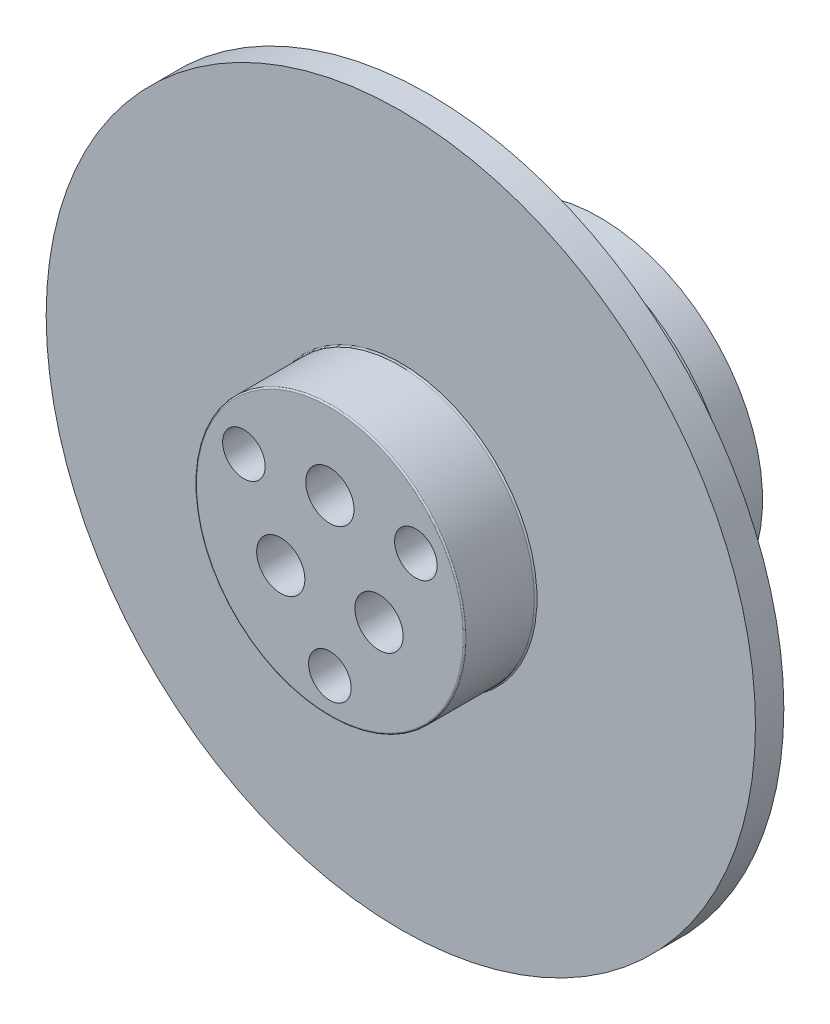
ISO-10303-21;
HEADER;
FILE_DESCRIPTION(('STEP AP214'),'2;1');
FILE_NAME('part.step','',(''),(''),'','','');
FILE_SCHEMA(('AUTOMOTIVE_DESIGN { 1 0 10303 214 1 1 1 1 }'));
ENDSEC;
DATA;
#1=APPLICATION_CONTEXT('core data for automotive mechanical design processes');
#2=APPLICATION_PROTOCOL_DEFINITION('international standard','automotive_design',2000,#1);
#3=PRODUCT_CONTEXT('',#1,'mechanical');
#4=PRODUCT('Part','Part','',(#3));
#5=PRODUCT_RELATED_PRODUCT_CATEGORY('part','',(#4));
#6=PRODUCT_DEFINITION_FORMATION('','',#4);
#7=PRODUCT_DEFINITION_CONTEXT('part definition',#1,'design');
#8=PRODUCT_DEFINITION('design','',#6,#7);
#9=PRODUCT_DEFINITION_SHAPE('','',#8);
#10=(LENGTH_UNIT() NAMED_UNIT(*) SI_UNIT(.MILLI.,.METRE.));
#11=(NAMED_UNIT(*) PLANE_ANGLE_UNIT() SI_UNIT($,.RADIAN.));
#12=(NAMED_UNIT(*) SI_UNIT($,.STERADIAN.) SOLID_ANGLE_UNIT());
#13=UNCERTAINTY_MEASURE_WITH_UNIT(LENGTH_MEASURE(1.E-05),#10,'distance_accuracy_value','');
#14=(GEOMETRIC_REPRESENTATION_CONTEXT(3) GLOBAL_UNCERTAINTY_ASSIGNED_CONTEXT((#13)) GLOBAL_UNIT_ASSIGNED_CONTEXT((#10,
#11,#12)) REPRESENTATION_CONTEXT('',''));
#15=CARTESIAN_POINT('',(0.,0.,0.));
#16=DIRECTION('',(0.,0.,1.));
#17=DIRECTION('',(1.,0.,0.));
#18=AXIS2_PLACEMENT_3D('',#15,#16,#17);
#19=CARTESIAN_POINT('',(0.,0.,5.));
#20=DIRECTION('',(0.,0.,1.));
#21=DIRECTION('',(1.,0.,0.));
#22=AXIS2_PLACEMENT_3D('',#19,#20,#21);
#23=PLANE('',#22);
#24=CARTESIAN_POINT('',(-6.0621778264911,3.49999999999994,5.));
#25=DIRECTION('',(0.,0.,1.));
#26=DIRECTION('',(1.,0.,0.));
#27=AXIS2_PLACEMENT_3D('',#24,#25,#26);
#28=CIRCLE('',#27,1.49999999999999);
#29=CARTESIAN_POINT('',(-4.56217782649111,3.49999999999994,5.));
#30=VERTEX_POINT('',#29);
#31=EDGE_CURVE('E95',#30,#30,#28,.T.);
#32=ORIENTED_EDGE('',*,*,#31,.F.);
#33=EDGE_LOOP('',(#32));
#34=FACE_BOUND('',#33,.T.);
#35=CARTESIAN_POINT('',(6.06217782649105,3.50000000000003,5.));
#36=DIRECTION('',(0.,0.,1.));
#37=DIRECTION('',(1.,0.,0.));
#38=AXIS2_PLACEMENT_3D('',#35,#36,#37);
#39=CIRCLE('',#38,1.49999999999999);
#40=CARTESIAN_POINT('',(7.56217782649104,3.50000000000003,5.));
#41=VERTEX_POINT('',#40);
#42=EDGE_CURVE('E101',#41,#41,#39,.T.);
#43=ORIENTED_EDGE('',*,*,#42,.F.);
#44=EDGE_LOOP('',(#43));
#45=FACE_BOUND('',#44,.T.);
#46=CARTESIAN_POINT('',(0.,-7.,5.));
#47=DIRECTION('',(0.,0.,1.));
#48=DIRECTION('',(1.,0.,0.));
#49=AXIS2_PLACEMENT_3D('',#46,#47,#48);
#50=CIRCLE('',#49,1.49999999999999);
#51=CARTESIAN_POINT('',(1.49999999999999,-7.,5.));
#52=VERTEX_POINT('',#51);
#53=EDGE_CURVE('E107',#52,#52,#50,.T.);
#54=ORIENTED_EDGE('',*,*,#53,.F.);
#55=EDGE_LOOP('',(#54));
#56=FACE_BOUND('',#55,.T.);
#57=CARTESIAN_POINT('',(0.,0.,5.));
#58=DIRECTION('',(0.,0.,1.));
#59=DIRECTION('',(1.,0.,0.));
#60=AXIS2_PLACEMENT_3D('',#57,#58,#59);
#61=CIRCLE('',#60,9.4);
#62=CARTESIAN_POINT('',(9.4,0.,5.));
#63=VERTEX_POINT('',#62);
#64=EDGE_CURVE('E11',#63,#63,#61,.T.);
#65=ORIENTED_EDGE('',*,*,#64,.T.);
#66=EDGE_LOOP('',(#65));
#67=FACE_BOUND('',#66,.T.);
#68=CARTESIAN_POINT('',(0.,4.,5.));
#69=DIRECTION('',(0.,0.,1.));
#70=DIRECTION('',(1.,0.,0.));
#71=AXIS2_PLACEMENT_3D('',#68,#69,#70);
#72=CIRCLE('',#71,1.7);
#73=CARTESIAN_POINT('',(1.7,4.,5.));
#74=VERTEX_POINT('',#73);
#75=EDGE_CURVE('E113',#74,#74,#72,.T.);
#76=ORIENTED_EDGE('',*,*,#75,.F.);
#77=EDGE_LOOP('',(#76));
#78=FACE_BOUND('',#77,.T.);
#79=CARTESIAN_POINT('',(-3.46410161513775,-2.00000000000002,5.));
#80=DIRECTION('',(0.,0.,1.));
#81=DIRECTION('',(1.,0.,0.));
#82=AXIS2_PLACEMENT_3D('',#79,#80,#81);
#83=CIRCLE('',#82,1.7);
#84=CARTESIAN_POINT('',(-1.76410161513775,-2.00000000000002,5.));
#85=VERTEX_POINT('',#84);
#86=EDGE_CURVE('E119',#85,#85,#83,.T.);
#87=ORIENTED_EDGE('',*,*,#86,.F.);
#88=EDGE_LOOP('',(#87));
#89=FACE_BOUND('',#88,.T.);
#90=CARTESIAN_POINT('',(3.46410161513777,-1.99999999999997,5.));
#91=DIRECTION('',(0.,0.,1.));
#92=DIRECTION('',(1.,0.,0.));
#93=AXIS2_PLACEMENT_3D('',#90,#91,#92);
#94=CIRCLE('',#93,1.7);
#95=CARTESIAN_POINT('',(5.16410161513777,-1.99999999999997,5.));
#96=VERTEX_POINT('',#95);
#97=EDGE_CURVE('E116',#96,#96,#94,.T.);
#98=ORIENTED_EDGE('',*,*,#97,.F.);
#99=EDGE_LOOP('',(#98));
#100=FACE_BOUND('',#99,.T.);
#101=ADVANCED_FACE('F41',(#34,#45,#56,#67,#78,#89,#100),#23,.T.);
#102=CARTESIAN_POINT('',(0.,0.,-2.));
#103=DIRECTION('',(0.,0.,-1.));
#104=DIRECTION('',(-1.,0.,0.));
#105=AXIS2_PLACEMENT_3D('',#102,#103,#104);
#106=PLANE('',#105);
#107=CARTESIAN_POINT('',(0.,0.,-2.));
#108=DIRECTION('',(0.,0.,-1.));
#109=DIRECTION('',(-1.,0.,0.));
#110=AXIS2_PLACEMENT_3D('',#107,#108,#109);
#111=CIRCLE('',#110,13.5);
#112=CARTESIAN_POINT('',(-13.5,0.,-2.));
#113=VERTEX_POINT('',#112);
#114=EDGE_CURVE('E178',#113,#113,#111,.T.);
#115=ORIENTED_EDGE('',*,*,#114,.F.);
#116=EDGE_LOOP('',(#115));
#117=FACE_BOUND('',#116,.T.);
#118=CARTESIAN_POINT('',(0.,0.,-2.));
#119=DIRECTION('',(0.,0.,-1.));
#120=DIRECTION('',(-1.,0.,0.));
#121=AXIS2_PLACEMENT_3D('',#118,#119,#120);
#122=CIRCLE('',#121,25.);
#123=CARTESIAN_POINT('',(-25.,0.,-2.));
#124=VERTEX_POINT('',#123);
#125=EDGE_CURVE('E181',#124,#124,#122,.T.);
#126=ORIENTED_EDGE('',*,*,#125,.T.);
#127=EDGE_LOOP('',(#126));
#128=FACE_BOUND('',#127,.T.);
#129=ADVANCED_FACE('F221',(#117,#128),#106,.T.);
#130=CARTESIAN_POINT('',(0.,0.,0.));
#131=DIRECTION('',(0.,0.,-1.));
#132=DIRECTION('',(-1.,0.,0.));
#133=AXIS2_PLACEMENT_3D('',#130,#131,#132);
#134=PLANE('',#133);
#135=CARTESIAN_POINT('',(0.,0.,0.));
#136=DIRECTION('',(0.,0.,-1.));
#137=DIRECTION('',(-1.,0.,0.));
#138=AXIS2_PLACEMENT_3D('',#135,#136,#137);
#139=CIRCLE('',#138,9.6);
#140=CARTESIAN_POINT('',(-9.6,0.,0.));
#141=VERTEX_POINT('',#140);
#142=EDGE_CURVE('E49',#141,#141,#139,.T.);
#143=ORIENTED_EDGE('',*,*,#142,.T.);
#144=EDGE_LOOP('',(#143));
#145=FACE_BOUND('',#144,.T.);
#146=CARTESIAN_POINT('',(0.,0.,0.));
#147=DIRECTION('',(0.,0.,-1.));
#148=DIRECTION('',(-1.,0.,0.));
#149=AXIS2_PLACEMENT_3D('',#146,#147,#148);
#150=CIRCLE('',#149,25.);
#151=CARTESIAN_POINT('',(-25.,0.,0.));
#152=VERTEX_POINT('',#151);
#153=EDGE_CURVE('E185',#152,#152,#150,.T.);
#154=ORIENTED_EDGE('',*,*,#153,.F.);
#155=EDGE_LOOP('',(#154));
#156=FACE_BOUND('',#155,.T.);
#157=ADVANCED_FACE('F199',(#145,#156),#134,.F.);
#158=CARTESIAN_POINT('',(0.,0.,-2.));
#159=DIRECTION('',(0.,0.,1.));
#160=DIRECTION('',(1.,0.,0.));
#161=AXIS2_PLACEMENT_3D('',#158,#159,#160);
#162=CYLINDRICAL_SURFACE('',#161,25.);
#163=ORIENTED_EDGE('',*,*,#125,.F.);
#164=EDGE_LOOP('',(#163));
#165=FACE_BOUND('',#164,.T.);
#166=ORIENTED_EDGE('',*,*,#153,.T.);
#167=EDGE_LOOP('',(#166));
#168=FACE_BOUND('',#167,.T.);
#169=ADVANCED_FACE('F282',(#165,#168),#162,.T.);
#170=CARTESIAN_POINT('',(0.,0.,-4.));
#171=DIRECTION('',(0.,0.,1.));
#172=DIRECTION('',(1.,0.,0.));
#173=AXIS2_PLACEMENT_3D('',#170,#171,#172);
#174=CYLINDRICAL_SURFACE('',#173,13.5);
#175=CARTESIAN_POINT('',(0.,0.,-4.));
#176=DIRECTION('',(0.,0.,-1.));
#177=DIRECTION('',(-1.,0.,0.));
#178=AXIS2_PLACEMENT_3D('',#175,#176,#177);
#179=CIRCLE('',#178,13.5);
#180=CARTESIAN_POINT('',(-13.5,0.,-4.));
#181=VERTEX_POINT('',#180);
#182=EDGE_CURVE('E182',#181,#181,#179,.T.);
#183=ORIENTED_EDGE('',*,*,#182,.F.);
#184=EDGE_LOOP('',(#183));
#185=FACE_BOUND('',#184,.T.);
#186=ORIENTED_EDGE('',*,*,#114,.T.);
#187=EDGE_LOOP('',(#186));
#188=FACE_BOUND('',#187,.T.);
#189=ADVANCED_FACE('F278',(#185,#188),#174,.T.);
#190=CARTESIAN_POINT('',(0.,0.,-4.));
#191=DIRECTION('',(0.,0.,-1.));
#192=DIRECTION('',(-1.,0.,0.));
#193=AXIS2_PLACEMENT_3D('',#190,#191,#192);
#194=PLANE('',#193);
#195=CARTESIAN_POINT('',(0.,0.,-4.));
#196=DIRECTION('',(0.,0.,-1.));
#197=DIRECTION('',(-1.,0.,0.));
#198=AXIS2_PLACEMENT_3D('',#195,#196,#197);
#199=CIRCLE('',#198,12.5);
#200=CARTESIAN_POINT('',(-12.5,0.,-4.));
#201=VERTEX_POINT('',#200);
#202=EDGE_CURVE('E148',#201,#201,#199,.T.);
#203=ORIENTED_EDGE('',*,*,#202,.F.);
#204=EDGE_LOOP('',(#203));
#205=FACE_BOUND('',#204,.T.);
#206=ORIENTED_EDGE('',*,*,#182,.T.);
#207=EDGE_LOOP('',(#206));
#208=FACE_BOUND('',#207,.T.);
#209=ADVANCED_FACE('F274',(#205,#208),#194,.T.);
#210=CARTESIAN_POINT('',(0.,0.,-11.));
#211=DIRECTION('',(0.,0.,1.));
#212=DIRECTION('',(1.,0.,0.));
#213=AXIS2_PLACEMENT_3D('',#210,#211,#212);
#214=CYLINDRICAL_SURFACE('',#213,12.5);
#215=CARTESIAN_POINT('',(0.,0.,-11.));
#216=DIRECTION('',(0.,0.,-1.));
#217=DIRECTION('',(-1.,0.,0.));
#218=AXIS2_PLACEMENT_3D('',#215,#216,#217);
#219=CIRCLE('',#218,12.5);
#220=CARTESIAN_POINT('',(-12.5,0.,-11.));
#221=VERTEX_POINT('',#220);
#222=EDGE_CURVE('E175',#221,#221,#219,.T.);
#223=ORIENTED_EDGE('',*,*,#222,.F.);
#224=EDGE_LOOP('',(#223));
#225=FACE_BOUND('',#224,.T.);
#226=ORIENTED_EDGE('',*,*,#202,.T.);
#227=EDGE_LOOP('',(#226));
#228=FACE_BOUND('',#227,.T.);
#229=ADVANCED_FACE('F270',(#225,#228),#214,.T.);
#230=CARTESIAN_POINT('',(0.,0.,-11.));
#231=DIRECTION('',(0.,0.,-1.));
#232=DIRECTION('',(-1.,0.,0.));
#233=AXIS2_PLACEMENT_3D('',#230,#231,#232);
#234=PLANE('',#233);
#235=CARTESIAN_POINT('',(0.,0.,-11.));
#236=DIRECTION('',(0.,0.,-1.));
#237=DIRECTION('',(-1.,0.,0.));
#238=AXIS2_PLACEMENT_3D('',#235,#236,#237);
#239=CIRCLE('',#238,11.5);
#240=CARTESIAN_POINT('',(-11.5,0.,-11.));
#241=VERTEX_POINT('',#240);
#242=EDGE_CURVE('E144',#241,#241,#239,.T.);
#243=ORIENTED_EDGE('',*,*,#242,.F.);
#244=EDGE_LOOP('',(#243));
#245=FACE_BOUND('',#244,.T.);
#246=ORIENTED_EDGE('',*,*,#222,.T.);
#247=EDGE_LOOP('',(#246));
#248=FACE_BOUND('',#247,.T.);
#249=ADVANCED_FACE('F266',(#245,#248),#234,.T.);
#250=CARTESIAN_POINT('',(0.,4.,-11.));
#251=DIRECTION('',(0.,0.,-1.));
#252=DIRECTION('',(-1.,0.,0.));
#253=AXIS2_PLACEMENT_3D('',#250,#251,#252);
#254=CYLINDRICAL_SURFACE('',#253,1.7);
#255=CARTESIAN_POINT('',(0.,4.,-7.6));
#256=DIRECTION('',(0.,0.,-1.));
#257=DIRECTION('',(-1.,0.,0.));
#258=AXIS2_PLACEMENT_3D('',#255,#256,#257);
#259=CIRCLE('',#258,1.7);
#260=CARTESIAN_POINT('',(-1.7,4.,-7.6));
#261=VERTEX_POINT('',#260);
#262=EDGE_CURVE('E172',#261,#261,#259,.T.);
#263=ORIENTED_EDGE('',*,*,#262,.T.);
#264=EDGE_LOOP('',(#263));
#265=FACE_BOUND('',#264,.T.);
#266=ORIENTED_EDGE('',*,*,#75,.T.);
#267=EDGE_LOOP('',(#266));
#268=FACE_BOUND('',#267,.T.);
#269=ADVANCED_FACE('F262',(#265,#268),#254,.F.);
#270=CARTESIAN_POINT('',(1.7,4.,-7.6));
#271=DIRECTION('',(0.,0.,1.));
#272=DIRECTION('',(1.,0.,0.));
#273=AXIS2_PLACEMENT_3D('',#270,#271,#272);
#274=PLANE('',#273);
#275=ORIENTED_EDGE('',*,*,#262,.F.);
#276=EDGE_LOOP('',(#275));
#277=FACE_BOUND('',#276,.T.);
#278=CARTESIAN_POINT('',(0.,4.,-7.6));
#279=DIRECTION('',(0.,0.,-1.));
#280=DIRECTION('',(-1.,0.,0.));
#281=AXIS2_PLACEMENT_3D('',#278,#279,#280);
#282=CIRCLE('',#281,3.25);
#283=CARTESIAN_POINT('',(-3.25,4.,-7.6));
#284=VERTEX_POINT('',#283);
#285=EDGE_CURVE('E169',#284,#284,#282,.T.);
#286=ORIENTED_EDGE('',*,*,#285,.T.);
#287=EDGE_LOOP('',(#286));
#288=FACE_BOUND('',#287,.T.);
#289=ADVANCED_FACE('F258',(#277,#288),#274,.F.);
#290=CARTESIAN_POINT('',(0.,4.,-11.));
#291=DIRECTION('',(0.,0.,-1.));
#292=DIRECTION('',(-1.,0.,0.));
#293=AXIS2_PLACEMENT_3D('',#290,#291,#292);
#294=CYLINDRICAL_SURFACE('',#293,3.25);
#295=ORIENTED_EDGE('',*,*,#285,.F.);
#296=EDGE_LOOP('',(#295));
#297=FACE_BOUND('',#296,.T.);
#298=CARTESIAN_POINT('',(0.,4.,-14.));
#299=DIRECTION('',(0.,0.,-1.));
#300=DIRECTION('',(-1.,0.,0.));
#301=AXIS2_PLACEMENT_3D('',#298,#299,#300);
#302=CIRCLE('',#301,3.25);
#303=CARTESIAN_POINT('',(-3.25,4.,-14.));
#304=VERTEX_POINT('',#303);
#305=EDGE_CURVE('E131',#304,#304,#302,.F.);
#306=ORIENTED_EDGE('',*,*,#305,.F.);
#307=EDGE_LOOP('',(#306));
#308=FACE_BOUND('',#307,.T.);
#309=ADVANCED_FACE('F254',(#297,#308),#294,.F.);
#310=CARTESIAN_POINT('',(-3.46410161513775,-2.00000000000002,-11.));
#311=DIRECTION('',(0.,0.,-1.));
#312=DIRECTION('',(-1.,0.,0.));
#313=AXIS2_PLACEMENT_3D('',#310,#311,#312);
#314=CYLINDRICAL_SURFACE('',#313,1.7);
#315=CARTESIAN_POINT('',(-3.46410161513775,-2.00000000000002,-7.6));
#316=DIRECTION('',(0.,0.,-1.));
#317=DIRECTION('',(-1.,0.,0.));
#318=AXIS2_PLACEMENT_3D('',#315,#316,#317);
#319=CIRCLE('',#318,1.7);
#320=CARTESIAN_POINT('',(-5.16410161513775,-2.00000000000002,-7.6));
#321=VERTEX_POINT('',#320);
#322=EDGE_CURVE('E166',#321,#321,#319,.T.);
#323=ORIENTED_EDGE('',*,*,#322,.T.);
#324=EDGE_LOOP('',(#323));
#325=FACE_BOUND('',#324,.T.);
#326=ORIENTED_EDGE('',*,*,#86,.T.);
#327=EDGE_LOOP('',(#326));
#328=FACE_BOUND('',#327,.T.);
#329=ADVANCED_FACE('F250',(#325,#328),#314,.F.);
#330=CARTESIAN_POINT('',(-1.76410161513775,-2.00000000000002,-7.6));
#331=DIRECTION('',(0.,0.,1.));
#332=DIRECTION('',(1.,0.,0.));
#333=AXIS2_PLACEMENT_3D('',#330,#331,#332);
#334=PLANE('',#333);
#335=ORIENTED_EDGE('',*,*,#322,.F.);
#336=EDGE_LOOP('',(#335));
#337=FACE_BOUND('',#336,.T.);
#338=CARTESIAN_POINT('',(-3.46410161513775,-2.00000000000002,-7.6));
#339=DIRECTION('',(0.,0.,-1.));
#340=DIRECTION('',(-1.,0.,0.));
#341=AXIS2_PLACEMENT_3D('',#338,#339,#340);
#342=CIRCLE('',#341,3.25);
#343=CARTESIAN_POINT('',(-6.71410161513775,-2.00000000000002,-7.6));
#344=VERTEX_POINT('',#343);
#345=EDGE_CURVE('E163',#344,#344,#342,.T.);
#346=ORIENTED_EDGE('',*,*,#345,.T.);
#347=EDGE_LOOP('',(#346));
#348=FACE_BOUND('',#347,.T.);
#349=ADVANCED_FACE('F243',(#337,#348),#334,.F.);
#350=CARTESIAN_POINT('',(-3.46410161513775,-2.00000000000002,-11.));
#351=DIRECTION('',(0.,0.,-1.));
#352=DIRECTION('',(-1.,0.,0.));
#353=AXIS2_PLACEMENT_3D('',#350,#351,#352);
#354=CYLINDRICAL_SURFACE('',#353,3.25);
#355=ORIENTED_EDGE('',*,*,#345,.F.);
#356=EDGE_LOOP('',(#355));
#357=FACE_BOUND('',#356,.T.);
#358=CARTESIAN_POINT('',(-3.46410161513775,-2.00000000000002,-14.));
#359=DIRECTION('',(0.,0.,-1.));
#360=DIRECTION('',(-1.,0.,0.));
#361=AXIS2_PLACEMENT_3D('',#358,#359,#360);
#362=CIRCLE('',#361,3.25);
#363=CARTESIAN_POINT('',(-6.71410161513775,-2.00000000000002,-14.));
#364=VERTEX_POINT('',#363);
#365=EDGE_CURVE('E128',#364,#364,#362,.F.);
#366=ORIENTED_EDGE('',*,*,#365,.F.);
#367=EDGE_LOOP('',(#366));
#368=FACE_BOUND('',#367,.T.);
#369=ADVANCED_FACE('F233',(#357,#368),#354,.F.);
#370=CARTESIAN_POINT('',(3.46410161513777,-1.99999999999997,-11.));
#371=DIRECTION('',(0.,0.,-1.));
#372=DIRECTION('',(-1.,0.,0.));
#373=AXIS2_PLACEMENT_3D('',#370,#371,#372);
#374=CYLINDRICAL_SURFACE('',#373,1.7);
#375=CARTESIAN_POINT('',(3.46410161513777,-1.99999999999997,-7.6));
#376=DIRECTION('',(0.,0.,-1.));
#377=DIRECTION('',(-1.,0.,0.));
#378=AXIS2_PLACEMENT_3D('',#375,#376,#377);
#379=CIRCLE('',#378,1.7);
#380=CARTESIAN_POINT('',(1.76410161513777,-1.99999999999997,-7.6));
#381=VERTEX_POINT('',#380);
#382=EDGE_CURVE('E160',#381,#381,#379,.T.);
#383=ORIENTED_EDGE('',*,*,#382,.T.);
#384=EDGE_LOOP('',(#383));
#385=FACE_BOUND('',#384,.T.);
#386=ORIENTED_EDGE('',*,*,#97,.T.);
#387=EDGE_LOOP('',(#386));
#388=FACE_BOUND('',#387,.T.);
#389=ADVANCED_FACE('F230',(#385,#388),#374,.F.);
#390=CARTESIAN_POINT('',(5.16410161513777,-1.99999999999997,-7.6));
#391=DIRECTION('',(0.,0.,1.));
#392=DIRECTION('',(1.,0.,0.));
#393=AXIS2_PLACEMENT_3D('',#390,#391,#392);
#394=PLANE('',#393);
#395=ORIENTED_EDGE('',*,*,#382,.F.);
#396=EDGE_LOOP('',(#395));
#397=FACE_BOUND('',#396,.T.);
#398=CARTESIAN_POINT('',(3.46410161513777,-1.99999999999997,-7.6));
#399=DIRECTION('',(0.,0.,-1.));
#400=DIRECTION('',(-1.,0.,0.));
#401=AXIS2_PLACEMENT_3D('',#398,#399,#400);
#402=CIRCLE('',#401,3.25);
#403=CARTESIAN_POINT('',(0.214101615137774,-1.99999999999997,-7.6));
#404=VERTEX_POINT('',#403);
#405=EDGE_CURVE('E157',#404,#404,#402,.T.);
#406=ORIENTED_EDGE('',*,*,#405,.T.);
#407=EDGE_LOOP('',(#406));
#408=FACE_BOUND('',#407,.T.);
#409=ADVANCED_FACE('F232',(#397,#408),#394,.F.);
#410=CARTESIAN_POINT('',(3.46410161513777,-1.99999999999997,-11.));
#411=DIRECTION('',(0.,0.,-1.));
#412=DIRECTION('',(-1.,0.,0.));
#413=AXIS2_PLACEMENT_3D('',#410,#411,#412);
#414=CYLINDRICAL_SURFACE('',#413,3.25);
#415=ORIENTED_EDGE('',*,*,#405,.F.);
#416=EDGE_LOOP('',(#415));
#417=FACE_BOUND('',#416,.T.);
#418=CARTESIAN_POINT('',(3.46410161513777,-1.99999999999997,-14.));
#419=DIRECTION('',(0.,0.,-1.));
#420=DIRECTION('',(-1.,0.,0.));
#421=AXIS2_PLACEMENT_3D('',#418,#419,#420);
#422=CIRCLE('',#421,3.25);
#423=CARTESIAN_POINT('',(0.214101615137774,-1.99999999999997,-14.));
#424=VERTEX_POINT('',#423);
#425=EDGE_CURVE('E134',#424,#424,#422,.F.);
#426=ORIENTED_EDGE('',*,*,#425,.F.);
#427=EDGE_LOOP('',(#426));
#428=FACE_BOUND('',#427,.T.);
#429=ADVANCED_FACE('F240',(#417,#428),#414,.F.);
#430=CARTESIAN_POINT('',(0.,0.,-14.));
#431=DIRECTION('',(0.,0.,1.));
#432=DIRECTION('',(1.,0.,0.));
#433=AXIS2_PLACEMENT_3D('',#430,#431,#432);
#434=CYLINDRICAL_SURFACE('',#433,11.5);
#435=CARTESIAN_POINT('',(0.,0.,-14.));
#436=DIRECTION('',(0.,0.,-1.));
#437=DIRECTION('',(-1.,0.,0.));
#438=AXIS2_PLACEMENT_3D('',#435,#436,#437);
#439=CIRCLE('',#438,11.5);
#440=CARTESIAN_POINT('',(-11.5,0.,-14.));
#441=VERTEX_POINT('',#440);
#442=EDGE_CURVE('E140',#441,#441,#439,.T.);
#443=ORIENTED_EDGE('',*,*,#442,.F.);
#444=EDGE_LOOP('',(#443));
#445=FACE_BOUND('',#444,.T.);
#446=ORIENTED_EDGE('',*,*,#242,.T.);
#447=EDGE_LOOP('',(#446));
#448=FACE_BOUND('',#447,.T.);
#449=ADVANCED_FACE('F354',(#445,#448),#434,.T.);
#450=CARTESIAN_POINT('',(0.,0.,-14.));
#451=DIRECTION('',(0.,0.,-1.));
#452=DIRECTION('',(-1.,0.,0.));
#453=AXIS2_PLACEMENT_3D('',#450,#451,#452);
#454=PLANE('',#453);
#455=CARTESIAN_POINT('',(4.24999999999998,-7.36121593216774,-14.));
#456=DIRECTION('',(0.,0.,-1.));
#457=DIRECTION('',(-1.,0.,0.));
#458=AXIS2_PLACEMENT_3D('',#455,#456,#457);
#459=CIRCLE('',#458,1.49999999999999);
#460=CARTESIAN_POINT('',(2.74999999999999,-7.36121593216774,-14.));
#461=VERTEX_POINT('',#460);
#462=EDGE_CURVE('E85',#461,#461,#459,.T.);
#463=ORIENTED_EDGE('',*,*,#462,.F.);
#464=EDGE_LOOP('',(#463));
#465=FACE_BOUND('',#464,.T.);
#466=CARTESIAN_POINT('',(-4.24999999999998,7.36121593216774,-14.));
#467=DIRECTION('',(0.,0.,-1.));
#468=DIRECTION('',(-1.,0.,0.));
#469=AXIS2_PLACEMENT_3D('',#466,#467,#468);
#470=CIRCLE('',#469,1.49999999999999);
#471=CARTESIAN_POINT('',(-5.74999999999997,7.36121593216774,-14.));
#472=VERTEX_POINT('',#471);
#473=EDGE_CURVE('E84',#472,#472,#470,.T.);
#474=ORIENTED_EDGE('',*,*,#473,.F.);
#475=EDGE_LOOP('',(#474));
#476=FACE_BOUND('',#475,.T.);
#477=CARTESIAN_POINT('',(-6.0621778264911,3.49999999999994,-14.));
#478=DIRECTION('',(0.,0.,-1.));
#479=DIRECTION('',(-1.,0.,0.));
#480=AXIS2_PLACEMENT_3D('',#477,#478,#479);
#481=CIRCLE('',#480,1.65);
#482=CARTESIAN_POINT('',(-7.7121778264911,3.49999999999994,-14.));
#483=VERTEX_POINT('',#482);
#484=EDGE_CURVE('E122',#483,#483,#481,.F.);
#485=ORIENTED_EDGE('',*,*,#484,.T.);
#486=EDGE_LOOP('',(#485));
#487=FACE_BOUND('',#486,.T.);
#488=CARTESIAN_POINT('',(0.,-7.,-14.));
#489=DIRECTION('',(0.,0.,-1.));
#490=DIRECTION('',(-1.,0.,0.));
#491=AXIS2_PLACEMENT_3D('',#488,#489,#490);
#492=CIRCLE('',#491,1.65);
#493=CARTESIAN_POINT('',(-1.65,-7.,-14.));
#494=VERTEX_POINT('',#493);
#495=EDGE_CURVE('E125',#494,#494,#492,.F.);
#496=ORIENTED_EDGE('',*,*,#495,.T.);
#497=EDGE_LOOP('',(#496));
#498=FACE_BOUND('',#497,.T.);
#499=ORIENTED_EDGE('',*,*,#365,.T.);
#500=EDGE_LOOP('',(#499));
#501=FACE_BOUND('',#500,.T.);
#502=ORIENTED_EDGE('',*,*,#305,.T.);
#503=EDGE_LOOP('',(#502));
#504=FACE_BOUND('',#503,.T.);
#505=ORIENTED_EDGE('',*,*,#425,.T.);
#506=EDGE_LOOP('',(#505));
#507=FACE_BOUND('',#506,.T.);
#508=CARTESIAN_POINT('',(6.06217782649106,3.50000000000003,-14.));
#509=DIRECTION('',(0.,0.,-1.));
#510=DIRECTION('',(-1.,0.,0.));
#511=AXIS2_PLACEMENT_3D('',#508,#509,#510);
#512=CIRCLE('',#511,1.65);
#513=CARTESIAN_POINT('',(4.41217782649106,3.50000000000003,-14.));
#514=VERTEX_POINT('',#513);
#515=EDGE_CURVE('E137',#514,#514,#512,.F.);
#516=ORIENTED_EDGE('',*,*,#515,.T.);
#517=EDGE_LOOP('',(#516));
#518=FACE_BOUND('',#517,.T.);
#519=ORIENTED_EDGE('',*,*,#442,.T.);
#520=EDGE_LOOP('',(#519));
#521=FACE_BOUND('',#520,.T.);
#522=ADVANCED_FACE('F363',(#465,#476,#487,#498,#501,#504,#507,#518,#521),#454,.T.);
#523=CARTESIAN_POINT('',(0.,-7.,-6.));
#524=DIRECTION('',(0.,0.,-1.));
#525=DIRECTION('',(-1.,0.,0.));
#526=AXIS2_PLACEMENT_3D('',#523,#524,#525);
#527=CONICAL_SURFACE('',#526,1.65,1.02974425867665);
#528=CARTESIAN_POINT('',(0.,-7.,-5.00857997860452));
#529=VERTEX_POINT('',#528);
#530=VERTEX_LOOP('',#529);
#531=FACE_BOUND('',#530,.T.);
#532=CARTESIAN_POINT('',(0.,-7.,-6.));
#533=DIRECTION('',(0.,0.,-1.));
#534=DIRECTION('',(-1.,0.,0.));
#535=AXIS2_PLACEMENT_3D('',#532,#533,#534);
#536=CIRCLE('',#535,1.65);
#537=CARTESIAN_POINT('',(-1.65,-7.,-6.));
#538=VERTEX_POINT('',#537);
#539=EDGE_CURVE('E154',#538,#538,#536,.T.);
#540=ORIENTED_EDGE('',*,*,#539,.T.);
#541=EDGE_LOOP('',(#540));
#542=FACE_BOUND('',#541,.T.);
#543=ADVANCED_FACE('F377',(#531,#542),#527,.F.);
#544=CARTESIAN_POINT('',(0.,-7.,-11.));
#545=DIRECTION('',(0.,0.,-1.));
#546=DIRECTION('',(-1.,0.,0.));
#547=AXIS2_PLACEMENT_3D('',#544,#545,#546);
#548=CYLINDRICAL_SURFACE('',#547,1.65);
#549=ORIENTED_EDGE('',*,*,#539,.F.);
#550=EDGE_LOOP('',(#549));
#551=FACE_BOUND('',#550,.T.);
#552=ORIENTED_EDGE('',*,*,#495,.F.);
#553=EDGE_LOOP('',(#552));
#554=FACE_BOUND('',#553,.T.);
#555=ADVANCED_FACE('F371',(#551,#554),#548,.F.);
#556=CARTESIAN_POINT('',(6.06217782649106,3.50000000000003,-6.));
#557=DIRECTION('',(0.,0.,-1.));
#558=DIRECTION('',(-1.,0.,0.));
#559=AXIS2_PLACEMENT_3D('',#556,#557,#558);
#560=CONICAL_SURFACE('',#559,1.65,1.02974425867665);
#561=CARTESIAN_POINT('',(6.06217782649105,3.50000000000003,-5.00857997860452));
#562=VERTEX_POINT('',#561);
#563=VERTEX_LOOP('',#562);
#564=FACE_BOUND('',#563,.T.);
#565=CARTESIAN_POINT('',(6.06217782649106,3.50000000000003,-6.));
#566=DIRECTION('',(0.,0.,-1.));
#567=DIRECTION('',(-1.,0.,0.));
#568=AXIS2_PLACEMENT_3D('',#565,#566,#567);
#569=CIRCLE('',#568,1.65);
#570=CARTESIAN_POINT('',(4.41217782649106,3.50000000000003,-6.));
#571=VERTEX_POINT('',#570);
#572=EDGE_CURVE('E151',#571,#571,#569,.T.);
#573=ORIENTED_EDGE('',*,*,#572,.T.);
#574=EDGE_LOOP('',(#573));
#575=FACE_BOUND('',#574,.T.);
#576=ADVANCED_FACE('F376',(#564,#575),#560,.F.);
#577=CARTESIAN_POINT('',(6.06217782649106,3.50000000000003,-11.));
#578=DIRECTION('',(0.,0.,-1.));
#579=DIRECTION('',(-1.,0.,0.));
#580=AXIS2_PLACEMENT_3D('',#577,#578,#579);
#581=CYLINDRICAL_SURFACE('',#580,1.65);
#582=ORIENTED_EDGE('',*,*,#572,.F.);
#583=EDGE_LOOP('',(#582));
#584=FACE_BOUND('',#583,.T.);
#585=ORIENTED_EDGE('',*,*,#515,.F.);
#586=EDGE_LOOP('',(#585));
#587=FACE_BOUND('',#586,.T.);
#588=ADVANCED_FACE('F387',(#584,#587),#581,.F.);
#589=CARTESIAN_POINT('',(-6.0621778264911,3.49999999999994,-6.));
#590=DIRECTION('',(0.,0.,-1.));
#591=DIRECTION('',(-1.,0.,0.));
#592=AXIS2_PLACEMENT_3D('',#589,#590,#591);
#593=CONICAL_SURFACE('',#592,1.65,1.02974425867665);
#594=CARTESIAN_POINT('',(-6.06217782649111,3.49999999999994,-5.00857997860452));
#595=VERTEX_POINT('',#594);
#596=VERTEX_LOOP('',#595);
#597=FACE_BOUND('',#596,.T.);
#598=CARTESIAN_POINT('',(-6.0621778264911,3.49999999999994,-6.));
#599=DIRECTION('',(0.,0.,-1.));
#600=DIRECTION('',(-1.,0.,0.));
#601=AXIS2_PLACEMENT_3D('',#598,#599,#600);
#602=CIRCLE('',#601,1.65);
#603=CARTESIAN_POINT('',(-7.7121778264911,3.49999999999994,-6.));
#604=VERTEX_POINT('',#603);
#605=EDGE_CURVE('E143',#604,#604,#602,.T.);
#606=ORIENTED_EDGE('',*,*,#605,.T.);
#607=EDGE_LOOP('',(#606));
#608=FACE_BOUND('',#607,.T.);
#609=ADVANCED_FACE('F391',(#597,#608),#593,.F.);
#610=CARTESIAN_POINT('',(-6.0621778264911,3.49999999999994,-11.));
#611=DIRECTION('',(0.,0.,-1.));
#612=DIRECTION('',(-1.,0.,0.));
#613=AXIS2_PLACEMENT_3D('',#610,#611,#612);
#614=CYLINDRICAL_SURFACE('',#613,1.65);
#615=ORIENTED_EDGE('',*,*,#605,.F.);
#616=EDGE_LOOP('',(#615));
#617=FACE_BOUND('',#616,.T.);
#618=ORIENTED_EDGE('',*,*,#484,.F.);
#619=EDGE_LOOP('',(#618));
#620=FACE_BOUND('',#619,.T.);
#621=ADVANCED_FACE('F210',(#617,#620),#614,.F.);
#622=CARTESIAN_POINT('',(0.,0.,0.));
#623=DIRECTION('',(0.,0.,1.));
#624=DIRECTION('',(1.,0.,0.));
#625=AXIS2_PLACEMENT_3D('',#622,#623,#624);
#626=CYLINDRICAL_SURFACE('',#625,9.5);
#627=CARTESIAN_POINT('',(0.,0.,0.0999999999999996));
#628=DIRECTION('',(0.,0.,-1.));
#629=DIRECTION('',(-1.,0.,0.));
#630=AXIS2_PLACEMENT_3D('',#627,#628,#629);
#631=CIRCLE('',#630,9.5);
#632=CARTESIAN_POINT('',(-9.5,0.,0.0999999999999996));
#633=VERTEX_POINT('',#632);
#634=EDGE_CURVE('E194',#633,#633,#631,.F.);
#635=ORIENTED_EDGE('',*,*,#634,.T.);
#636=EDGE_LOOP('',(#635));
#637=FACE_BOUND('',#636,.T.);
#638=CARTESIAN_POINT('',(0.,0.,4.9));
#639=DIRECTION('',(0.,0.,1.));
#640=DIRECTION('',(1.,0.,0.));
#641=AXIS2_PLACEMENT_3D('',#638,#639,#640);
#642=CIRCLE('',#641,9.5);
#643=CARTESIAN_POINT('',(9.5,0.,4.9));
#644=VERTEX_POINT('',#643);
#645=EDGE_CURVE('E147',#644,#644,#642,.F.);
#646=ORIENTED_EDGE('',*,*,#645,.T.);
#647=EDGE_LOOP('',(#646));
#648=FACE_BOUND('',#647,.T.);
#649=ADVANCED_FACE('F205',(#637,#648),#626,.T.);
#650=CARTESIAN_POINT('',(0.,0.,0.0999999999999996));
#651=DIRECTION('',(0.,0.,-1.));
#652=DIRECTION('',(-1.,0.,0.));
#653=AXIS2_PLACEMENT_3D('',#650,#651,#652);
#654=TOROIDAL_SURFACE('',#653,9.6,0.1);
#655=ORIENTED_EDGE('',*,*,#142,.F.);
#656=EDGE_LOOP('',(#655));
#657=FACE_BOUND('',#656,.T.);
#658=ORIENTED_EDGE('',*,*,#634,.F.);
#659=EDGE_LOOP('',(#658));
#660=FACE_BOUND('',#659,.T.);
#661=ADVANCED_FACE('F202',(#657,#660),#654,.F.);
#662=CARTESIAN_POINT('',(0.,0.,4.9));
#663=DIRECTION('',(0.,0.,1.));
#664=DIRECTION('',(1.,0.,0.));
#665=AXIS2_PLACEMENT_3D('',#662,#663,#664);
#666=TOROIDAL_SURFACE('',#665,9.4,0.1);
#667=ORIENTED_EDGE('',*,*,#645,.F.);
#668=EDGE_LOOP('',(#667));
#669=FACE_BOUND('',#668,.T.);
#670=ORIENTED_EDGE('',*,*,#64,.F.);
#671=EDGE_LOOP('',(#670));
#672=FACE_BOUND('',#671,.T.);
#673=ADVANCED_FACE('F43',(#669,#672),#666,.T.);
#674=CARTESIAN_POINT('',(0.,-7.,0.));
#675=DIRECTION('',(0.,0.,1.));
#676=DIRECTION('',(1.,0.,0.));
#677=AXIS2_PLACEMENT_3D('',#674,#675,#676);
#678=CONICAL_SURFACE('',#677,1.5,1.02974425867665);
#679=CARTESIAN_POINT('',(0.,-7.,-0.901290928541342));
#680=VERTEX_POINT('',#679);
#681=VERTEX_LOOP('',#680);
#682=FACE_BOUND('',#681,.T.);
#683=CARTESIAN_POINT('',(0.,-7.,0.));
#684=DIRECTION('',(0.,0.,1.));
#685=DIRECTION('',(1.,0.,0.));
#686=AXIS2_PLACEMENT_3D('',#683,#684,#685);
#687=CIRCLE('',#686,1.5);
#688=CARTESIAN_POINT('',(1.5,-7.,0.));
#689=VERTEX_POINT('',#688);
#690=EDGE_CURVE('E110',#689,#689,#687,.T.);
#691=ORIENTED_EDGE('',*,*,#690,.T.);
#692=EDGE_LOOP('',(#691));
#693=FACE_BOUND('',#692,.T.);
#694=ADVANCED_FACE('F216',(#682,#693),#678,.F.);
#695=CARTESIAN_POINT('',(0.,-7.,5.));
#696=DIRECTION('',(0.,0.,1.));
#697=DIRECTION('',(1.,0.,0.));
#698=AXIS2_PLACEMENT_3D('',#695,#696,#697);
#699=CYLINDRICAL_SURFACE('',#698,1.49999999999999);
#700=ORIENTED_EDGE('',*,*,#690,.F.);
#701=EDGE_LOOP('',(#700));
#702=FACE_BOUND('',#701,.T.);
#703=ORIENTED_EDGE('',*,*,#53,.T.);
#704=EDGE_LOOP('',(#703));
#705=FACE_BOUND('',#704,.T.);
#706=ADVANCED_FACE('F424',(#702,#705),#699,.F.);
#707=CARTESIAN_POINT('',(6.06217782649105,3.50000000000003,0.));
#708=DIRECTION('',(0.,0.,1.));
#709=DIRECTION('',(1.,0.,0.));
#710=AXIS2_PLACEMENT_3D('',#707,#708,#709);
#711=CONICAL_SURFACE('',#710,1.5,1.02974425867665);
#712=CARTESIAN_POINT('',(6.06217782649105,3.50000000000003,-0.901290928541342));
#713=VERTEX_POINT('',#712);
#714=VERTEX_LOOP('',#713);
#715=FACE_BOUND('',#714,.T.);
#716=CARTESIAN_POINT('',(6.06217782649105,3.50000000000003,0.));
#717=DIRECTION('',(0.,0.,1.));
#718=DIRECTION('',(1.,0.,0.));
#719=AXIS2_PLACEMENT_3D('',#716,#717,#718);
#720=CIRCLE('',#719,1.5);
#721=CARTESIAN_POINT('',(7.56217782649105,3.50000000000003,0.));
#722=VERTEX_POINT('',#721);
#723=EDGE_CURVE('E104',#722,#722,#720,.T.);
#724=ORIENTED_EDGE('',*,*,#723,.T.);
#725=EDGE_LOOP('',(#724));
#726=FACE_BOUND('',#725,.T.);
#727=ADVANCED_FACE('F432',(#715,#726),#711,.F.);
#728=CARTESIAN_POINT('',(6.06217782649105,3.50000000000003,5.));
#729=DIRECTION('',(0.,0.,1.));
#730=DIRECTION('',(1.,0.,0.));
#731=AXIS2_PLACEMENT_3D('',#728,#729,#730);
#732=CYLINDRICAL_SURFACE('',#731,1.49999999999999);
#733=ORIENTED_EDGE('',*,*,#723,.F.);
#734=EDGE_LOOP('',(#733));
#735=FACE_BOUND('',#734,.T.);
#736=ORIENTED_EDGE('',*,*,#42,.T.);
#737=EDGE_LOOP('',(#736));
#738=FACE_BOUND('',#737,.T.);
#739=ADVANCED_FACE('F441',(#735,#738),#732,.F.);
#740=CARTESIAN_POINT('',(-6.0621778264911,3.49999999999994,0.));
#741=DIRECTION('',(0.,0.,1.));
#742=DIRECTION('',(1.,0.,0.));
#743=AXIS2_PLACEMENT_3D('',#740,#741,#742);
#744=CONICAL_SURFACE('',#743,1.5,1.02974425867665);
#745=CARTESIAN_POINT('',(-6.0621778264911,3.49999999999994,-0.901290928541342));
#746=VERTEX_POINT('',#745);
#747=VERTEX_LOOP('',#746);
#748=FACE_BOUND('',#747,.T.);
#749=CARTESIAN_POINT('',(-6.0621778264911,3.49999999999994,0.));
#750=DIRECTION('',(0.,0.,1.));
#751=DIRECTION('',(1.,0.,0.));
#752=AXIS2_PLACEMENT_3D('',#749,#750,#751);
#753=CIRCLE('',#752,1.5);
#754=CARTESIAN_POINT('',(-4.56217782649111,3.49999999999994,0.));
#755=VERTEX_POINT('',#754);
#756=EDGE_CURVE('E98',#755,#755,#753,.T.);
#757=ORIENTED_EDGE('',*,*,#756,.T.);
#758=EDGE_LOOP('',(#757));
#759=FACE_BOUND('',#758,.T.);
#760=ADVANCED_FACE('F449',(#748,#759),#744,.F.);
#761=CARTESIAN_POINT('',(-6.0621778264911,3.49999999999994,5.));
#762=DIRECTION('',(0.,0.,1.));
#763=DIRECTION('',(1.,0.,0.));
#764=AXIS2_PLACEMENT_3D('',#761,#762,#763);
#765=CYLINDRICAL_SURFACE('',#764,1.49999999999999);
#766=ORIENTED_EDGE('',*,*,#756,.F.);
#767=EDGE_LOOP('',(#766));
#768=FACE_BOUND('',#767,.T.);
#769=ORIENTED_EDGE('',*,*,#31,.T.);
#770=EDGE_LOOP('',(#769));
#771=FACE_BOUND('',#770,.T.);
#772=ADVANCED_FACE('F457',(#768,#771),#765,.F.);
#773=CARTESIAN_POINT('',(-4.24999999999998,7.36121593216774,-8.99999999999999));
#774=DIRECTION('',(0.,0.,-1.));
#775=DIRECTION('',(-1.,0.,0.));
#776=AXIS2_PLACEMENT_3D('',#773,#774,#775);
#777=CONICAL_SURFACE('',#776,1.49999999999999,1.02974425867665);
#778=CARTESIAN_POINT('',(-4.24999999999998,7.36121593216774,-8.09870907145866));
#779=VERTEX_POINT('',#778);
#780=VERTEX_LOOP('',#779);
#781=FACE_BOUND('',#780,.T.);
#782=CARTESIAN_POINT('',(-4.24999999999998,7.36121593216774,-8.99999999999999));
#783=DIRECTION('',(0.,0.,-1.));
#784=DIRECTION('',(-1.,0.,0.));
#785=AXIS2_PLACEMENT_3D('',#782,#783,#784);
#786=CIRCLE('',#785,1.49999999999999);
#787=CARTESIAN_POINT('',(-5.74999999999997,7.36121593216774,-8.99999999999999));
#788=VERTEX_POINT('',#787);
#789=EDGE_CURVE('E88',#788,#788,#786,.T.);
#790=ORIENTED_EDGE('',*,*,#789,.T.);
#791=EDGE_LOOP('',(#790));
#792=FACE_BOUND('',#791,.T.);
#793=ADVANCED_FACE('F465',(#781,#792),#777,.F.);
#794=CARTESIAN_POINT('',(-4.24999999999998,7.36121593216774,-14.));
#795=DIRECTION('',(0.,0.,-1.));
#796=DIRECTION('',(-1.,0.,0.));
#797=AXIS2_PLACEMENT_3D('',#794,#795,#796);
#798=CYLINDRICAL_SURFACE('',#797,1.49999999999999);
#799=ORIENTED_EDGE('',*,*,#789,.F.);
#800=EDGE_LOOP('',(#799));
#801=FACE_BOUND('',#800,.T.);
#802=ORIENTED_EDGE('',*,*,#473,.T.);
#803=EDGE_LOOP('',(#802));
#804=FACE_BOUND('',#803,.T.);
#805=ADVANCED_FACE('F78',(#801,#804),#798,.F.);
#806=CARTESIAN_POINT('',(4.24999999999998,-7.36121593216774,-8.99999999999999));
#807=DIRECTION('',(0.,0.,-1.));
#808=DIRECTION('',(-1.,0.,0.));
#809=AXIS2_PLACEMENT_3D('',#806,#807,#808);
#810=CONICAL_SURFACE('',#809,1.49999999999999,1.02974425867665);
#811=CARTESIAN_POINT('',(4.24999999999998,-7.36121593216774,-8.09870907145866));
#812=VERTEX_POINT('',#811);
#813=VERTEX_LOOP('',#812);
#814=FACE_BOUND('',#813,.T.);
#815=CARTESIAN_POINT('',(4.24999999999998,-7.36121593216774,-8.99999999999999));
#816=DIRECTION('',(0.,0.,-1.));
#817=DIRECTION('',(-1.,0.,0.));
#818=AXIS2_PLACEMENT_3D('',#815,#816,#817);
#819=CIRCLE('',#818,1.49999999999999);
#820=CARTESIAN_POINT('',(2.74999999999999,-7.36121593216774,-8.99999999999999));
#821=VERTEX_POINT('',#820);
#822=EDGE_CURVE('E82',#821,#821,#819,.T.);
#823=ORIENTED_EDGE('',*,*,#822,.T.);
#824=EDGE_LOOP('',(#823));
#825=FACE_BOUND('',#824,.T.);
#826=ADVANCED_FACE('F74',(#814,#825),#810,.F.);
#827=CARTESIAN_POINT('',(4.24999999999998,-7.36121593216774,-14.));
#828=DIRECTION('',(0.,0.,-1.));
#829=DIRECTION('',(-1.,0.,0.));
#830=AXIS2_PLACEMENT_3D('',#827,#828,#829);
#831=CYLINDRICAL_SURFACE('',#830,1.49999999999999);
#832=ORIENTED_EDGE('',*,*,#822,.F.);
#833=EDGE_LOOP('',(#832));
#834=FACE_BOUND('',#833,.T.);
#835=ORIENTED_EDGE('',*,*,#462,.T.);
#836=EDGE_LOOP('',(#835));
#837=FACE_BOUND('',#836,.T.);
#838=ADVANCED_FACE('F77',(#834,#837),#831,.F.);
#839=CLOSED_SHELL('',(#101,#129,#157,#169,#189,#209,#229,#249,#269,#289,#309,#329,#349,#369,
#389,#409,#429,#449,#522,#543,#555,#576,#588,#609,#621,#649,#661,#673,#694,#706,#727,#739,#760,
#772,#793,#805,#826,#838));
#840=MANIFOLD_SOLID_BREP('B2',#839);
#841=ADVANCED_BREP_SHAPE_REPRESENTATION('',(#18,#840),#14);
#842=SHAPE_DEFINITION_REPRESENTATION(#9,#841);
ENDSEC;
END-ISO-10303-21;
